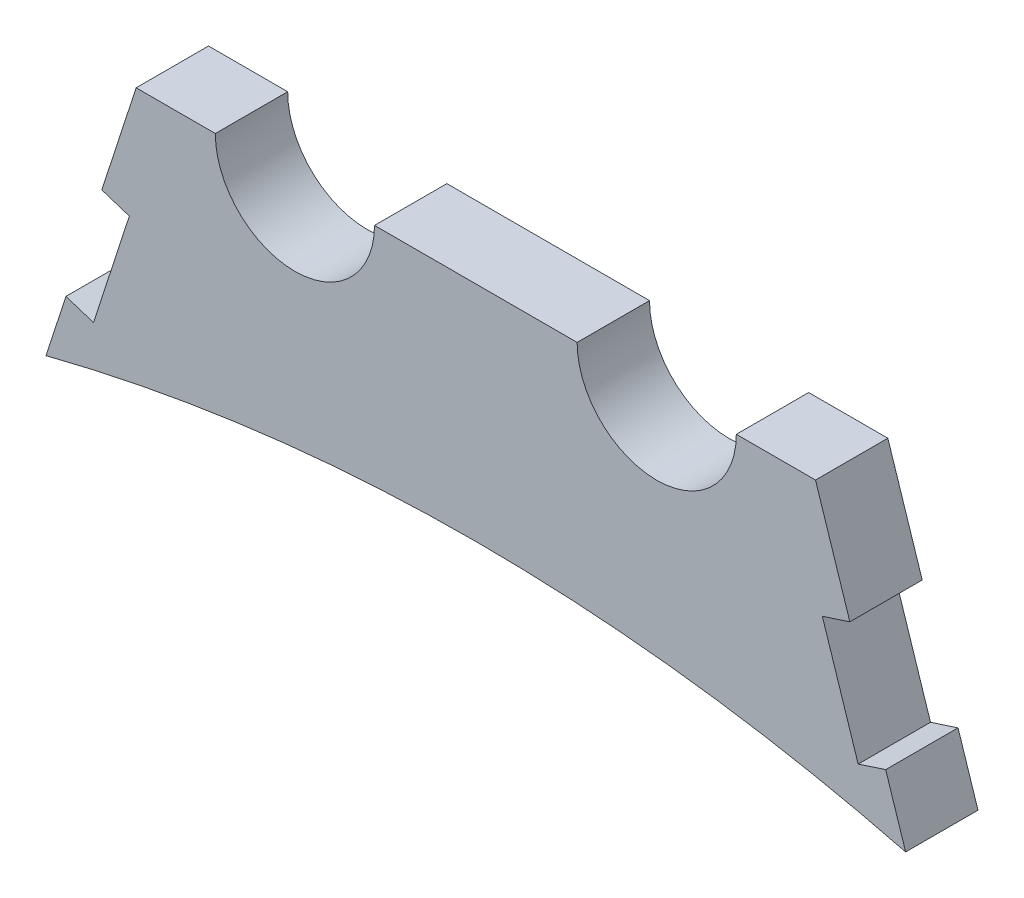
ISO-10303-21;
HEADER;
FILE_DESCRIPTION(('STEP AP214'),'2;1');
FILE_NAME('part.step','',(''),(''),'','','');
FILE_SCHEMA(('AUTOMOTIVE_DESIGN { 1 0 10303 214 1 1 1 1 }'));
ENDSEC;
DATA;
#1=APPLICATION_CONTEXT('core data for automotive mechanical design processes');
#2=APPLICATION_PROTOCOL_DEFINITION('international standard','automotive_design',2000,#1);
#3=PRODUCT_CONTEXT('',#1,'mechanical');
#4=PRODUCT('Part','Part','',(#3));
#5=PRODUCT_RELATED_PRODUCT_CATEGORY('part','',(#4));
#6=PRODUCT_DEFINITION_FORMATION('','',#4);
#7=PRODUCT_DEFINITION_CONTEXT('part definition',#1,'design');
#8=PRODUCT_DEFINITION('design','',#6,#7);
#9=PRODUCT_DEFINITION_SHAPE('','',#8);
#10=(LENGTH_UNIT() NAMED_UNIT(*) SI_UNIT(.MILLI.,.METRE.));
#11=(NAMED_UNIT(*) PLANE_ANGLE_UNIT() SI_UNIT($,.RADIAN.));
#12=(NAMED_UNIT(*) SI_UNIT($,.STERADIAN.) SOLID_ANGLE_UNIT());
#13=UNCERTAINTY_MEASURE_WITH_UNIT(LENGTH_MEASURE(1.E-05),#10,'distance_accuracy_value','');
#14=(GEOMETRIC_REPRESENTATION_CONTEXT(3) GLOBAL_UNCERTAINTY_ASSIGNED_CONTEXT((#13)) GLOBAL_UNIT_ASSIGNED_CONTEXT((#10,
#11,#12)) REPRESENTATION_CONTEXT('',''));
#15=CARTESIAN_POINT('',(0.,0.,0.));
#16=DIRECTION('',(0.,0.,1.));
#17=DIRECTION('',(1.,0.,0.));
#18=AXIS2_PLACEMENT_3D('',#15,#16,#17);
#19=CARTESIAN_POINT('',(0.,0.,6.35));
#20=DIRECTION('',(0.,0.,-1.));
#21=DIRECTION('',(-1.,0.,0.));
#22=AXIS2_PLACEMENT_3D('',#19,#20,#21);
#23=CYLINDRICAL_SURFACE('',#22,152.4);
#24=CARTESIAN_POINT('',(0.,0.,0.));
#25=DIRECTION('',(0.,0.,-1.));
#26=DIRECTION('',(1.,0.,0.));
#27=AXIS2_PLACEMENT_3D('',#24,#25,#26);
#28=CIRCLE('',#27,152.4);
#29=CARTESIAN_POINT('',(-37.7172395441766,147.658964648839,0.));
#30=VERTEX_POINT('',#29);
#31=CARTESIAN_POINT('',(37.7172395441766,147.658964648839,0.));
#32=VERTEX_POINT('',#31);
#33=EDGE_CURVE('E188',#30,#32,#28,.T.);
#34=ORIENTED_EDGE('',*,*,#33,.T.);
#35=DIRECTION('',(0.,0.,-1.));
#36=VECTOR('',#35,1.);
#37=CARTESIAN_POINT('',(37.7172395441766,147.658964648839,6.35));
#38=LINE('',#37,#36);
#39=CARTESIAN_POINT('',(37.7172395441766,147.658964648839,6.35));
#40=VERTEX_POINT('',#39);
#41=EDGE_CURVE('E11',#40,#32,#38,.T.);
#42=ORIENTED_EDGE('',*,*,#41,.F.);
#43=CARTESIAN_POINT('',(0.,0.,6.35));
#44=DIRECTION('',(0.,0.,-1.));
#45=DIRECTION('',(1.,0.,0.));
#46=AXIS2_PLACEMENT_3D('',#43,#44,#45);
#47=CIRCLE('',#46,152.4);
#48=CARTESIAN_POINT('',(-37.7172395441766,147.658964648839,6.35));
#49=VERTEX_POINT('',#48);
#50=EDGE_CURVE('E234',#49,#40,#47,.T.);
#51=ORIENTED_EDGE('',*,*,#50,.F.);
#52=DIRECTION('',(0.,0.,-1.));
#53=VECTOR('',#52,1.);
#54=CARTESIAN_POINT('',(-37.7172395441766,147.658964648839,6.35));
#55=LINE('',#54,#53);
#56=EDGE_CURVE('E184',#49,#30,#55,.T.);
#57=ORIENTED_EDGE('',*,*,#56,.T.);
#58=EDGE_LOOP('',(#34,#42,#51,#57));
#59=FACE_BOUND('',#58,.T.);
#60=ADVANCED_FACE('F39',(#59),#23,.F.);
#61=CARTESIAN_POINT('',(37.7172395441766,147.658964648839,6.35));
#62=DIRECTION('',(-0.950933726670704,-0.309394646818859,0.));
#63=DIRECTION('',(0.309394646818859,-0.950933726670704,0.));
#64=AXIS2_PLACEMENT_3D('',#61,#62,#63);
#65=PLANE('',#64);
#66=DIRECTION('',(-0.309394646818859,0.950933726670704,0.));
#67=VECTOR('',#66,1.);
#68=CARTESIAN_POINT('',(37.7172395441766,147.658964648839,0.));
#69=LINE('',#68,#67);
#70=CARTESIAN_POINT('',(35.9654874234463,153.043027332201,0.));
#71=VERTEX_POINT('',#70);
#72=EDGE_CURVE('E192',#32,#71,#69,.T.);
#73=ORIENTED_EDGE('',*,*,#72,.T.);
#74=DIRECTION('',(0.,0.,-1.));
#75=VECTOR('',#74,1.);
#76=CARTESIAN_POINT('',(35.9654874234463,153.043027332201,6.35));
#77=LINE('',#76,#75);
#78=CARTESIAN_POINT('',(35.9654874234463,153.043027332201,6.35));
#79=VERTEX_POINT('',#78);
#80=EDGE_CURVE('E48',#79,#71,#77,.T.);
#81=ORIENTED_EDGE('',*,*,#80,.F.);
#82=DIRECTION('',(-0.309394646818859,0.950933726670704,0.));
#83=VECTOR('',#82,1.);
#84=CARTESIAN_POINT('',(37.7172395441766,147.658964648839,6.35));
#85=LINE('',#84,#83);
#86=EDGE_CURVE('E123',#40,#79,#85,.T.);
#87=ORIENTED_EDGE('',*,*,#86,.F.);
#88=ORIENTED_EDGE('',*,*,#41,.T.);
#89=EDGE_LOOP('',(#73,#81,#87,#88));
#90=FACE_BOUND('',#89,.T.);
#91=ADVANCED_FACE('F356',(#90),#65,.F.);
#92=CARTESIAN_POINT('',(33.5501157577026,152.257164929281,6.35));
#93=DIRECTION('',(0.309394646818878,-0.950933726670698,0.));
#94=DIRECTION('',(0.950933726670698,0.309394646818878,0.));
#95=AXIS2_PLACEMENT_3D('',#92,#93,#94);
#96=PLANE('',#95);
#97=DIRECTION('',(-0.950933726670698,-0.309394646818878,0.));
#98=VECTOR('',#97,1.);
#99=CARTESIAN_POINT('',(33.5501157577026,152.257164929281,0.));
#100=LINE('',#99,#98);
#101=CARTESIAN_POINT('',(33.5501157577026,152.257164929281,0.));
#102=VERTEX_POINT('',#101);
#103=EDGE_CURVE('E195',#71,#102,#100,.T.);
#104=ORIENTED_EDGE('',*,*,#103,.T.);
#105=DIRECTION('',(0.,0.,-1.));
#106=VECTOR('',#105,1.);
#107=CARTESIAN_POINT('',(33.5501157577026,152.257164929281,6.35));
#108=LINE('',#107,#106);
#109=CARTESIAN_POINT('',(33.5501157577026,152.257164929281,6.35));
#110=VERTEX_POINT('',#109);
#111=EDGE_CURVE('E277',#110,#102,#108,.T.);
#112=ORIENTED_EDGE('',*,*,#111,.F.);
#113=DIRECTION('',(-0.950933726670698,-0.309394646818878,0.));
#114=VECTOR('',#113,1.);
#115=CARTESIAN_POINT('',(33.5501157577026,152.257164929281,6.35));
#116=LINE('',#115,#114);
#117=EDGE_CURVE('E287',#79,#110,#116,.T.);
#118=ORIENTED_EDGE('',*,*,#117,.F.);
#119=ORIENTED_EDGE('',*,*,#80,.T.);
#120=EDGE_LOOP('',(#104,#112,#118,#119));
#121=FACE_BOUND('',#120,.T.);
#122=ADVANCED_FACE('F285',(#121),#96,.F.);
#123=CARTESIAN_POINT('',(30.406666146023,161.918651592256,6.35));
#124=DIRECTION('',(-0.950933726670705,-0.309394646818857,0.));
#125=DIRECTION('',(0.309394646818857,-0.950933726670705,0.));
#126=AXIS2_PLACEMENT_3D('',#123,#124,#125);
#127=PLANE('',#126);
#128=DIRECTION('',(-0.309394646818857,0.950933726670705,0.));
#129=VECTOR('',#128,1.);
#130=CARTESIAN_POINT('',(30.406666146023,161.918651592256,0.));
#131=LINE('',#130,#129);
#132=CARTESIAN_POINT('',(30.406666146023,161.918651592256,0.));
#133=VERTEX_POINT('',#132);
#134=EDGE_CURVE('E198',#102,#133,#131,.T.);
#135=ORIENTED_EDGE('',*,*,#134,.T.);
#136=DIRECTION('',(0.,0.,-1.));
#137=VECTOR('',#136,1.);
#138=CARTESIAN_POINT('',(30.406666146023,161.918651592256,6.35));
#139=LINE('',#138,#137);
#140=CARTESIAN_POINT('',(30.406666146023,161.918651592256,6.35));
#141=VERTEX_POINT('',#140);
#142=EDGE_CURVE('E273',#141,#133,#139,.T.);
#143=ORIENTED_EDGE('',*,*,#142,.F.);
#144=DIRECTION('',(-0.309394646818857,0.950933726670705,0.));
#145=VECTOR('',#144,1.);
#146=CARTESIAN_POINT('',(30.406666146023,161.918651592256,6.35));
#147=LINE('',#146,#145);
#148=EDGE_CURVE('E306',#110,#141,#147,.T.);
#149=ORIENTED_EDGE('',*,*,#148,.F.);
#150=ORIENTED_EDGE('',*,*,#111,.T.);
#151=EDGE_LOOP('',(#135,#143,#149,#150));
#152=FACE_BOUND('',#151,.T.);
#153=ADVANCED_FACE('F296',(#152),#127,.F.);
#154=CARTESIAN_POINT('',(30.406666146023,161.918651592256,6.35));
#155=DIRECTION('',(-0.309394646818876,0.950933726670699,0.));
#156=DIRECTION('',(-0.950933726670699,-0.309394646818876,0.));
#157=AXIS2_PLACEMENT_3D('',#154,#155,#156);
#158=PLANE('',#157);
#159=DIRECTION('',(0.950933726670699,0.309394646818876,0.));
#160=VECTOR('',#159,1.);
#161=CARTESIAN_POINT('',(30.406666146023,161.918651592256,0.));
#162=LINE('',#161,#160);
#163=CARTESIAN_POINT('',(32.8220378117666,162.704513995176,0.));
#164=VERTEX_POINT('',#163);
#165=EDGE_CURVE('E201',#133,#164,#162,.T.);
#166=ORIENTED_EDGE('',*,*,#165,.T.);
#167=DIRECTION('',(0.,0.,-1.));
#168=VECTOR('',#167,1.);
#169=CARTESIAN_POINT('',(32.8220378117666,162.704513995176,6.35));
#170=LINE('',#169,#168);
#171=CARTESIAN_POINT('',(32.8220378117666,162.704513995176,6.35));
#172=VERTEX_POINT('',#171);
#173=EDGE_CURVE('E269',#172,#164,#170,.T.);
#174=ORIENTED_EDGE('',*,*,#173,.F.);
#175=DIRECTION('',(0.950933726670699,0.309394646818876,0.));
#176=VECTOR('',#175,1.);
#177=CARTESIAN_POINT('',(30.406666146023,161.918651592256,6.35));
#178=LINE('',#177,#176);
#179=EDGE_CURVE('E302',#141,#172,#178,.T.);
#180=ORIENTED_EDGE('',*,*,#179,.F.);
#181=ORIENTED_EDGE('',*,*,#142,.T.);
#182=EDGE_LOOP('',(#166,#174,#180,#181));
#183=FACE_BOUND('',#182,.T.);
#184=ADVANCED_FACE('F300',(#183),#158,.F.);
#185=CARTESIAN_POINT('',(32.8220378117666,162.704513995176,6.35));
#186=DIRECTION('',(-0.950933726670705,-0.309394646818857,0.));
#187=DIRECTION('',(0.309394646818857,-0.950933726670705,0.));
#188=AXIS2_PLACEMENT_3D('',#185,#186,#187);
#189=PLANE('',#188);
#190=DIRECTION('',(-0.309394646818857,0.950933726670705,0.));
#191=VECTOR('',#190,1.);
#192=CARTESIAN_POINT('',(32.8220378117666,162.704513995176,0.));
#193=LINE('',#192,#191);
#194=CARTESIAN_POINT('',(29.8065433367642,171.972726707815,0.));
#195=VERTEX_POINT('',#194);
#196=EDGE_CURVE('E204',#164,#195,#193,.T.);
#197=ORIENTED_EDGE('',*,*,#196,.T.);
#198=DIRECTION('',(0.,0.,-1.));
#199=VECTOR('',#198,1.);
#200=CARTESIAN_POINT('',(29.8065433367642,171.972726707815,6.35));
#201=LINE('',#200,#199);
#202=CARTESIAN_POINT('',(29.8065433367642,171.972726707815,6.35));
#203=VERTEX_POINT('',#202);
#204=EDGE_CURVE('E265',#203,#195,#201,.T.);
#205=ORIENTED_EDGE('',*,*,#204,.F.);
#206=DIRECTION('',(-0.309394646818857,0.950933726670705,0.));
#207=VECTOR('',#206,1.);
#208=CARTESIAN_POINT('',(32.8220378117666,162.704513995176,6.35));
#209=LINE('',#208,#207);
#210=EDGE_CURVE('E305',#172,#203,#209,.T.);
#211=ORIENTED_EDGE('',*,*,#210,.F.);
#212=ORIENTED_EDGE('',*,*,#173,.T.);
#213=EDGE_LOOP('',(#197,#205,#211,#212));
#214=FACE_BOUND('',#213,.T.);
#215=ADVANCED_FACE('F369',(#214),#189,.F.);
#216=CARTESIAN_POINT('',(29.8065433367642,171.972726707815,6.35));
#217=DIRECTION('',(0.,-1.,0.));
#218=DIRECTION('',(0.,0.,-1.));
#219=AXIS2_PLACEMENT_3D('',#216,#217,#218);
#220=PLANE('',#219);
#221=DIRECTION('',(-1.,0.,0.));
#222=VECTOR('',#221,1.);
#223=CARTESIAN_POINT('',(29.8065433367642,171.972726707815,0.));
#224=LINE('',#223,#222);
#225=CARTESIAN_POINT('',(22.86,171.972726707815,0.));
#226=VERTEX_POINT('',#225);
#227=EDGE_CURVE('E207',#195,#226,#224,.T.);
#228=ORIENTED_EDGE('',*,*,#227,.T.);
#229=DIRECTION('',(0.,0.,-1.));
#230=VECTOR('',#229,1.);
#231=CARTESIAN_POINT('',(22.86,171.972726707815,6.35));
#232=LINE('',#231,#230);
#233=CARTESIAN_POINT('',(22.86,171.972726707815,6.35));
#234=VERTEX_POINT('',#233);
#235=EDGE_CURVE('E261',#234,#226,#232,.T.);
#236=ORIENTED_EDGE('',*,*,#235,.F.);
#237=DIRECTION('',(-1.,0.,0.));
#238=VECTOR('',#237,1.);
#239=CARTESIAN_POINT('',(29.8065433367642,171.972726707815,6.35));
#240=LINE('',#239,#238);
#241=EDGE_CURVE('E310',#203,#234,#240,.T.);
#242=ORIENTED_EDGE('',*,*,#241,.F.);
#243=ORIENTED_EDGE('',*,*,#204,.T.);
#244=EDGE_LOOP('',(#228,#236,#242,#243));
#245=FACE_BOUND('',#244,.T.);
#246=ADVANCED_FACE('F372',(#245),#220,.F.);
#247=CARTESIAN_POINT('',(15.875,171.972726707815,6.35));
#248=DIRECTION('',(0.,0.,-1.));
#249=DIRECTION('',(-1.,0.,0.));
#250=AXIS2_PLACEMENT_3D('',#247,#248,#249);
#251=CYLINDRICAL_SURFACE('',#250,6.985);
#252=CARTESIAN_POINT('',(15.875,171.972726707815,0.));
#253=DIRECTION('',(0.,0.,-1.));
#254=DIRECTION('',(-1.,0.,0.));
#255=AXIS2_PLACEMENT_3D('',#252,#253,#254);
#256=CIRCLE('',#255,6.985);
#257=CARTESIAN_POINT('',(8.89,171.972726707815,0.));
#258=VERTEX_POINT('',#257);
#259=EDGE_CURVE('E210',#226,#258,#256,.T.);
#260=ORIENTED_EDGE('',*,*,#259,.T.);
#261=DIRECTION('',(0.,0.,-1.));
#262=VECTOR('',#261,1.);
#263=CARTESIAN_POINT('',(8.89,171.972726707815,6.35));
#264=LINE('',#263,#262);
#265=CARTESIAN_POINT('',(8.89,171.972726707815,6.35));
#266=VERTEX_POINT('',#265);
#267=EDGE_CURVE('E257',#266,#258,#264,.T.);
#268=ORIENTED_EDGE('',*,*,#267,.F.);
#269=CARTESIAN_POINT('',(15.875,171.972726707815,6.35));
#270=DIRECTION('',(0.,0.,-1.));
#271=DIRECTION('',(-1.,0.,0.));
#272=AXIS2_PLACEMENT_3D('',#269,#270,#271);
#273=CIRCLE('',#272,6.985);
#274=EDGE_CURVE('E317',#234,#266,#273,.T.);
#275=ORIENTED_EDGE('',*,*,#274,.F.);
#276=ORIENTED_EDGE('',*,*,#235,.T.);
#277=EDGE_LOOP('',(#260,#268,#275,#276));
#278=FACE_BOUND('',#277,.T.);
#279=ADVANCED_FACE('F376',(#278),#251,.F.);
#280=CARTESIAN_POINT('',(-8.89,171.972726707815,6.35));
#281=DIRECTION('',(0.,-1.,0.));
#282=DIRECTION('',(0.,0.,-1.));
#283=AXIS2_PLACEMENT_3D('',#280,#281,#282);
#284=PLANE('',#283);
#285=DIRECTION('',(-1.,0.,0.));
#286=VECTOR('',#285,1.);
#287=CARTESIAN_POINT('',(-8.89,171.972726707815,0.));
#288=LINE('',#287,#286);
#289=CARTESIAN_POINT('',(-8.89,171.972726707815,0.));
#290=VERTEX_POINT('',#289);
#291=EDGE_CURVE('E213',#258,#290,#288,.T.);
#292=ORIENTED_EDGE('',*,*,#291,.T.);
#293=DIRECTION('',(0.,0.,-1.));
#294=VECTOR('',#293,1.);
#295=CARTESIAN_POINT('',(-8.89,171.972726707815,6.35));
#296=LINE('',#295,#294);
#297=CARTESIAN_POINT('',(-8.89,171.972726707815,6.35));
#298=VERTEX_POINT('',#297);
#299=EDGE_CURVE('E253',#298,#290,#296,.T.);
#300=ORIENTED_EDGE('',*,*,#299,.F.);
#301=DIRECTION('',(-1.,0.,0.));
#302=VECTOR('',#301,1.);
#303=CARTESIAN_POINT('',(-8.89,171.972726707815,6.35));
#304=LINE('',#303,#302);
#305=EDGE_CURVE('E320',#266,#298,#304,.T.);
#306=ORIENTED_EDGE('',*,*,#305,.F.);
#307=ORIENTED_EDGE('',*,*,#267,.T.);
#308=EDGE_LOOP('',(#292,#300,#306,#307));
#309=FACE_BOUND('',#308,.T.);
#310=ADVANCED_FACE('F380',(#309),#284,.F.);
#311=CARTESIAN_POINT('',(-15.875,171.972726707815,6.35));
#312=DIRECTION('',(0.,0.,-1.));
#313=DIRECTION('',(-1.,0.,0.));
#314=AXIS2_PLACEMENT_3D('',#311,#312,#313);
#315=CYLINDRICAL_SURFACE('',#314,6.985);
#316=CARTESIAN_POINT('',(-15.875,171.972726707815,0.));
#317=DIRECTION('',(0.,0.,-1.));
#318=DIRECTION('',(1.,0.,0.));
#319=AXIS2_PLACEMENT_3D('',#316,#317,#318);
#320=CIRCLE('',#319,6.985);
#321=CARTESIAN_POINT('',(-22.86,171.972726707815,0.));
#322=VERTEX_POINT('',#321);
#323=EDGE_CURVE('E216',#290,#322,#320,.T.);
#324=ORIENTED_EDGE('',*,*,#323,.T.);
#325=DIRECTION('',(0.,0.,-1.));
#326=VECTOR('',#325,1.);
#327=CARTESIAN_POINT('',(-22.86,171.972726707815,6.35));
#328=LINE('',#327,#326);
#329=CARTESIAN_POINT('',(-22.86,171.972726707815,6.35));
#330=VERTEX_POINT('',#329);
#331=EDGE_CURVE('E249',#330,#322,#328,.T.);
#332=ORIENTED_EDGE('',*,*,#331,.F.);
#333=CARTESIAN_POINT('',(-15.875,171.972726707815,6.35));
#334=DIRECTION('',(0.,0.,-1.));
#335=DIRECTION('',(1.,0.,0.));
#336=AXIS2_PLACEMENT_3D('',#333,#334,#335);
#337=CIRCLE('',#336,6.985);
#338=EDGE_CURVE('E323',#298,#330,#337,.T.);
#339=ORIENTED_EDGE('',*,*,#338,.F.);
#340=ORIENTED_EDGE('',*,*,#299,.T.);
#341=EDGE_LOOP('',(#324,#332,#339,#340));
#342=FACE_BOUND('',#341,.T.);
#343=ADVANCED_FACE('F384',(#342),#315,.F.);
#344=CARTESIAN_POINT('',(-29.8065433367642,171.972726707815,6.35));
#345=DIRECTION('',(0.,-1.,0.));
#346=DIRECTION('',(0.,0.,-1.));
#347=AXIS2_PLACEMENT_3D('',#344,#345,#346);
#348=PLANE('',#347);
#349=DIRECTION('',(-1.,0.,0.));
#350=VECTOR('',#349,1.);
#351=CARTESIAN_POINT('',(-29.8065433367642,171.972726707815,0.));
#352=LINE('',#351,#350);
#353=CARTESIAN_POINT('',(-29.8065433367642,171.972726707815,0.));
#354=VERTEX_POINT('',#353);
#355=EDGE_CURVE('E219',#322,#354,#352,.T.);
#356=ORIENTED_EDGE('',*,*,#355,.T.);
#357=DIRECTION('',(0.,0.,-1.));
#358=VECTOR('',#357,1.);
#359=CARTESIAN_POINT('',(-29.8065433367642,171.972726707815,6.35));
#360=LINE('',#359,#358);
#361=CARTESIAN_POINT('',(-29.8065433367642,171.972726707815,6.35));
#362=VERTEX_POINT('',#361);
#363=EDGE_CURVE('E245',#362,#354,#360,.T.);
#364=ORIENTED_EDGE('',*,*,#363,.F.);
#365=DIRECTION('',(-1.,0.,0.));
#366=VECTOR('',#365,1.);
#367=CARTESIAN_POINT('',(-29.8065433367642,171.972726707815,6.35));
#368=LINE('',#367,#366);
#369=EDGE_CURVE('E326',#330,#362,#368,.T.);
#370=ORIENTED_EDGE('',*,*,#369,.F.);
#371=ORIENTED_EDGE('',*,*,#331,.T.);
#372=EDGE_LOOP('',(#356,#364,#370,#371));
#373=FACE_BOUND('',#372,.T.);
#374=ADVANCED_FACE('F388',(#373),#348,.F.);
#375=CARTESIAN_POINT('',(-32.8220378117667,162.704513995176,6.35));
#376=DIRECTION('',(0.950933726670704,-0.309394646818861,0.));
#377=DIRECTION('',(0.309394646818861,0.950933726670704,0.));
#378=AXIS2_PLACEMENT_3D('',#375,#376,#377);
#379=PLANE('',#378);
#380=DIRECTION('',(-0.309394646818861,-0.950933726670704,0.));
#381=VECTOR('',#380,1.);
#382=CARTESIAN_POINT('',(-32.8220378117667,162.704513995176,0.));
#383=LINE('',#382,#381);
#384=CARTESIAN_POINT('',(-32.8220378117667,162.704513995176,0.));
#385=VERTEX_POINT('',#384);
#386=EDGE_CURVE('E222',#354,#385,#383,.T.);
#387=ORIENTED_EDGE('',*,*,#386,.T.);
#388=DIRECTION('',(0.,0.,-1.));
#389=VECTOR('',#388,1.);
#390=CARTESIAN_POINT('',(-32.8220378117667,162.704513995176,6.35));
#391=LINE('',#390,#389);
#392=CARTESIAN_POINT('',(-32.8220378117667,162.704513995176,6.35));
#393=VERTEX_POINT('',#392);
#394=EDGE_CURVE('E241',#393,#385,#391,.T.);
#395=ORIENTED_EDGE('',*,*,#394,.F.);
#396=DIRECTION('',(-0.309394646818861,-0.950933726670704,0.));
#397=VECTOR('',#396,1.);
#398=CARTESIAN_POINT('',(-32.8220378117667,162.704513995176,6.35));
#399=LINE('',#398,#397);
#400=EDGE_CURVE('E329',#362,#393,#399,.T.);
#401=ORIENTED_EDGE('',*,*,#400,.F.);
#402=ORIENTED_EDGE('',*,*,#363,.T.);
#403=EDGE_LOOP('',(#387,#395,#401,#402));
#404=FACE_BOUND('',#403,.T.);
#405=ADVANCED_FACE('F337',(#404),#379,.F.);
#406=CARTESIAN_POINT('',(-30.4066661460231,161.918651592256,6.35));
#407=DIRECTION('',(0.309394646818856,0.950933726670705,0.));
#408=DIRECTION('',(-0.950933726670705,0.309394646818856,0.));
#409=AXIS2_PLACEMENT_3D('',#406,#407,#408);
#410=PLANE('',#409);
#411=DIRECTION('',(0.950933726670705,-0.309394646818856,0.));
#412=VECTOR('',#411,1.);
#413=CARTESIAN_POINT('',(-30.4066661460231,161.918651592256,0.));
#414=LINE('',#413,#412);
#415=CARTESIAN_POINT('',(-30.4066661460231,161.918651592256,0.));
#416=VERTEX_POINT('',#415);
#417=EDGE_CURVE('E225',#385,#416,#414,.T.);
#418=ORIENTED_EDGE('',*,*,#417,.T.);
#419=DIRECTION('',(0.,0.,-1.));
#420=VECTOR('',#419,1.);
#421=CARTESIAN_POINT('',(-30.4066661460231,161.918651592256,6.35));
#422=LINE('',#421,#420);
#423=CARTESIAN_POINT('',(-30.4066661460231,161.918651592256,6.35));
#424=VERTEX_POINT('',#423);
#425=EDGE_CURVE('E177',#424,#416,#422,.T.);
#426=ORIENTED_EDGE('',*,*,#425,.F.);
#427=DIRECTION('',(0.950933726670705,-0.309394646818856,0.));
#428=VECTOR('',#427,1.);
#429=CARTESIAN_POINT('',(-30.4066661460231,161.918651592256,6.35));
#430=LINE('',#429,#428);
#431=EDGE_CURVE('E166',#393,#424,#430,.T.);
#432=ORIENTED_EDGE('',*,*,#431,.F.);
#433=ORIENTED_EDGE('',*,*,#394,.T.);
#434=EDGE_LOOP('',(#418,#426,#432,#433));
#435=FACE_BOUND('',#434,.T.);
#436=ADVANCED_FACE('F341',(#435),#410,.F.);
#437=CARTESIAN_POINT('',(-30.4066661460231,161.918651592256,6.35));
#438=DIRECTION('',(0.950933726670704,-0.30939464681886,0.));
#439=DIRECTION('',(0.30939464681886,0.950933726670704,0.));
#440=AXIS2_PLACEMENT_3D('',#437,#438,#439);
#441=PLANE('',#440);
#442=DIRECTION('',(-0.30939464681886,-0.950933726670704,0.));
#443=VECTOR('',#442,1.);
#444=CARTESIAN_POINT('',(-30.4066661460231,161.918651592256,0.));
#445=LINE('',#444,#443);
#446=CARTESIAN_POINT('',(-33.5501157577027,152.257164929281,0.));
#447=VERTEX_POINT('',#446);
#448=EDGE_CURVE('E175',#416,#447,#445,.T.);
#449=ORIENTED_EDGE('',*,*,#448,.T.);
#450=DIRECTION('',(0.,0.,-1.));
#451=VECTOR('',#450,1.);
#452=CARTESIAN_POINT('',(-33.5501157577027,152.257164929281,6.35));
#453=LINE('',#452,#451);
#454=CARTESIAN_POINT('',(-33.5501157577027,152.257164929281,6.35));
#455=VERTEX_POINT('',#454);
#456=EDGE_CURVE('E172',#455,#447,#453,.T.);
#457=ORIENTED_EDGE('',*,*,#456,.F.);
#458=DIRECTION('',(-0.30939464681886,-0.950933726670704,0.));
#459=VECTOR('',#458,1.);
#460=CARTESIAN_POINT('',(-30.4066661460231,161.918651592256,6.35));
#461=LINE('',#460,#459);
#462=EDGE_CURVE('E160',#424,#455,#461,.T.);
#463=ORIENTED_EDGE('',*,*,#462,.F.);
#464=ORIENTED_EDGE('',*,*,#425,.T.);
#465=EDGE_LOOP('',(#449,#457,#463,#464));
#466=FACE_BOUND('',#465,.T.);
#467=ADVANCED_FACE('F173',(#466),#441,.F.);
#468=CARTESIAN_POINT('',(-33.5501157577027,152.257164929281,6.35));
#469=DIRECTION('',(-0.309394646818857,-0.950933726670705,0.));
#470=DIRECTION('',(0.950933726670705,-0.309394646818857,0.));
#471=AXIS2_PLACEMENT_3D('',#468,#469,#470);
#472=PLANE('',#471);
#473=DIRECTION('',(-0.950933726670705,0.309394646818857,0.));
#474=VECTOR('',#473,1.);
#475=CARTESIAN_POINT('',(-33.5501157577027,152.257164929281,0.));
#476=LINE('',#475,#474);
#477=CARTESIAN_POINT('',(-35.9654874234463,153.043027332201,0.));
#478=VERTEX_POINT('',#477);
#479=EDGE_CURVE('E109',#447,#478,#476,.T.);
#480=ORIENTED_EDGE('',*,*,#479,.T.);
#481=DIRECTION('',(0.,0.,-1.));
#482=VECTOR('',#481,1.);
#483=CARTESIAN_POINT('',(-35.9654874234463,153.043027332201,6.35));
#484=LINE('',#483,#482);
#485=CARTESIAN_POINT('',(-35.9654874234463,153.043027332201,6.35));
#486=VERTEX_POINT('',#485);
#487=EDGE_CURVE('E178',#486,#478,#484,.T.);
#488=ORIENTED_EDGE('',*,*,#487,.F.);
#489=DIRECTION('',(-0.950933726670705,0.309394646818857,0.));
#490=VECTOR('',#489,1.);
#491=CARTESIAN_POINT('',(-33.5501157577027,152.257164929281,6.35));
#492=LINE('',#491,#490);
#493=EDGE_CURVE('E164',#455,#486,#492,.T.);
#494=ORIENTED_EDGE('',*,*,#493,.F.);
#495=ORIENTED_EDGE('',*,*,#456,.T.);
#496=EDGE_LOOP('',(#480,#488,#494,#495));
#497=FACE_BOUND('',#496,.T.);
#498=ADVANCED_FACE('F180',(#497),#472,.F.);
#499=CARTESIAN_POINT('',(-37.7172395441766,147.658964648839,6.35));
#500=DIRECTION('',(0.950933726670704,-0.30939464681886,0.));
#501=DIRECTION('',(0.30939464681886,0.950933726670704,0.));
#502=AXIS2_PLACEMENT_3D('',#499,#500,#501);
#503=PLANE('',#502);
#504=DIRECTION('',(-0.30939464681886,-0.950933726670704,0.));
#505=VECTOR('',#504,1.);
#506=CARTESIAN_POINT('',(-37.7172395441766,147.658964648839,0.));
#507=LINE('',#506,#505);
#508=EDGE_CURVE('E115',#478,#30,#507,.T.);
#509=ORIENTED_EDGE('',*,*,#508,.T.);
#510=ORIENTED_EDGE('',*,*,#56,.F.);
#511=DIRECTION('',(-0.30939464681886,-0.950933726670704,0.));
#512=VECTOR('',#511,1.);
#513=CARTESIAN_POINT('',(-37.7172395441766,147.658964648839,6.35));
#514=LINE('',#513,#512);
#515=EDGE_CURVE('E56',#486,#49,#514,.T.);
#516=ORIENTED_EDGE('',*,*,#515,.F.);
#517=ORIENTED_EDGE('',*,*,#487,.T.);
#518=EDGE_LOOP('',(#509,#510,#516,#517));
#519=FACE_BOUND('',#518,.T.);
#520=ADVANCED_FACE('F345',(#519),#503,.F.);
#521=CARTESIAN_POINT('',(0.,0.,6.35));
#522=DIRECTION('',(0.,0.,1.));
#523=DIRECTION('',(1.,0.,0.));
#524=AXIS2_PLACEMENT_3D('',#521,#522,#523);
#525=PLANE('',#524);
#526=ORIENTED_EDGE('',*,*,#50,.T.);
#527=ORIENTED_EDGE('',*,*,#86,.T.);
#528=ORIENTED_EDGE('',*,*,#117,.T.);
#529=ORIENTED_EDGE('',*,*,#148,.T.);
#530=ORIENTED_EDGE('',*,*,#179,.T.);
#531=ORIENTED_EDGE('',*,*,#210,.T.);
#532=ORIENTED_EDGE('',*,*,#241,.T.);
#533=ORIENTED_EDGE('',*,*,#274,.T.);
#534=ORIENTED_EDGE('',*,*,#305,.T.);
#535=ORIENTED_EDGE('',*,*,#338,.T.);
#536=ORIENTED_EDGE('',*,*,#369,.T.);
#537=ORIENTED_EDGE('',*,*,#400,.T.);
#538=ORIENTED_EDGE('',*,*,#431,.T.);
#539=ORIENTED_EDGE('',*,*,#462,.T.);
#540=ORIENTED_EDGE('',*,*,#493,.T.);
#541=ORIENTED_EDGE('',*,*,#515,.T.);
#542=EDGE_LOOP('',(#526,#527,#528,#529,#530,#531,#532,#533,#534,#535,#536,#537,#538,#539,#540,#541));
#543=FACE_BOUND('',#542,.T.);
#544=ADVANCED_FACE('F162',(#543),#525,.T.);
#545=CARTESIAN_POINT('',(0.,0.,0.));
#546=DIRECTION('',(0.,0.,1.));
#547=DIRECTION('',(1.,0.,0.));
#548=AXIS2_PLACEMENT_3D('',#545,#546,#547);
#549=PLANE('',#548);
#550=ORIENTED_EDGE('',*,*,#33,.F.);
#551=ORIENTED_EDGE('',*,*,#508,.F.);
#552=ORIENTED_EDGE('',*,*,#479,.F.);
#553=ORIENTED_EDGE('',*,*,#448,.F.);
#554=ORIENTED_EDGE('',*,*,#417,.F.);
#555=ORIENTED_EDGE('',*,*,#386,.F.);
#556=ORIENTED_EDGE('',*,*,#355,.F.);
#557=ORIENTED_EDGE('',*,*,#323,.F.);
#558=ORIENTED_EDGE('',*,*,#291,.F.);
#559=ORIENTED_EDGE('',*,*,#259,.F.);
#560=ORIENTED_EDGE('',*,*,#227,.F.);
#561=ORIENTED_EDGE('',*,*,#196,.F.);
#562=ORIENTED_EDGE('',*,*,#165,.F.);
#563=ORIENTED_EDGE('',*,*,#134,.F.);
#564=ORIENTED_EDGE('',*,*,#103,.F.);
#565=ORIENTED_EDGE('',*,*,#72,.F.);
#566=EDGE_LOOP('',(#550,#551,#552,#553,#554,#555,#556,#557,#558,#559,#560,#561,#562,#563,#564,#565));
#567=FACE_BOUND('',#566,.T.);
#568=ADVANCED_FACE('F291',(#567),#549,.F.);
#569=CLOSED_SHELL('',(#60,#91,#122,#153,#184,#215,#246,#279,#310,#343,#374,#405,#436,#467,#498,
#520,#544,#568));
#570=MANIFOLD_SOLID_BREP('B2',#569);
#571=ADVANCED_BREP_SHAPE_REPRESENTATION('',(#18,#570),#14);
#572=SHAPE_DEFINITION_REPRESENTATION(#9,#571);
ENDSEC;
END-ISO-10303-21;
